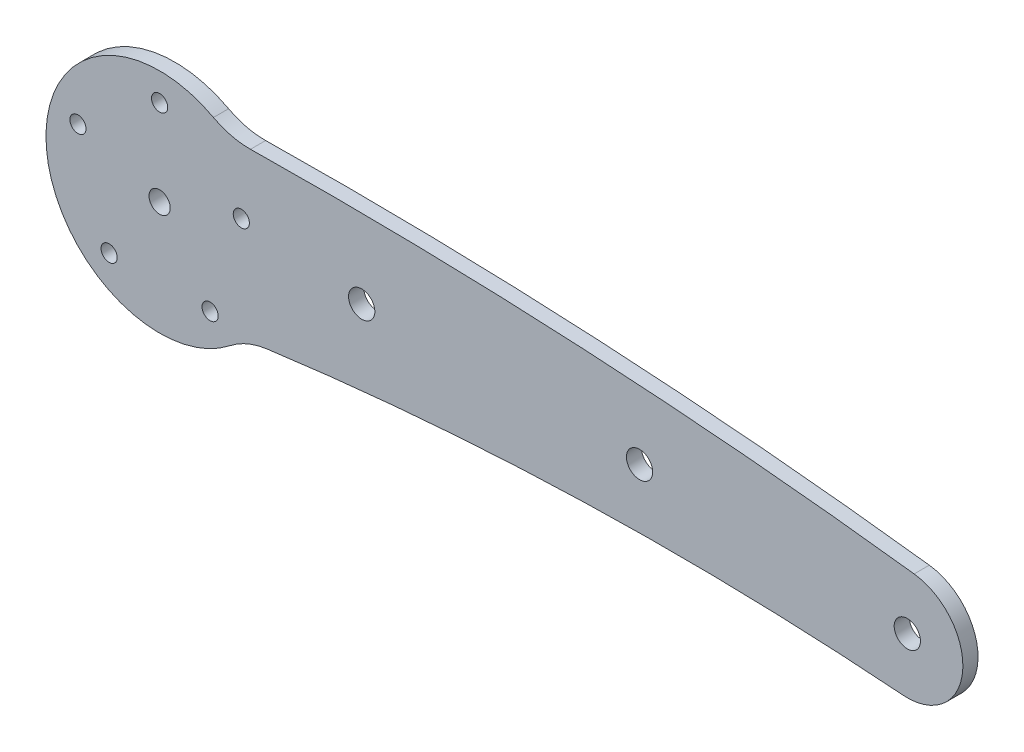
ISO-10303-21;
HEADER;
FILE_DESCRIPTION(('STEP AP214'),'2;1');
FILE_NAME('part.step','',(''),(''),'','','');
FILE_SCHEMA(('AUTOMOTIVE_DESIGN { 1 0 10303 214 1 1 1 1 }'));
ENDSEC;
DATA;
#1=APPLICATION_CONTEXT('core data for automotive mechanical design processes');
#2=APPLICATION_PROTOCOL_DEFINITION('international standard','automotive_design',2000,#1);
#3=PRODUCT_CONTEXT('',#1,'mechanical');
#4=PRODUCT('Part','Part','',(#3));
#5=PRODUCT_RELATED_PRODUCT_CATEGORY('part','',(#4));
#6=PRODUCT_DEFINITION_FORMATION('','',#4);
#7=PRODUCT_DEFINITION_CONTEXT('part definition',#1,'design');
#8=PRODUCT_DEFINITION('design','',#6,#7);
#9=PRODUCT_DEFINITION_SHAPE('','',#8);
#10=(LENGTH_UNIT() NAMED_UNIT(*) SI_UNIT(.MILLI.,.METRE.));
#11=(NAMED_UNIT(*) PLANE_ANGLE_UNIT() SI_UNIT($,.RADIAN.));
#12=(NAMED_UNIT(*) SI_UNIT($,.STERADIAN.) SOLID_ANGLE_UNIT());
#13=UNCERTAINTY_MEASURE_WITH_UNIT(LENGTH_MEASURE(1.E-05),#10,'distance_accuracy_value','');
#14=(GEOMETRIC_REPRESENTATION_CONTEXT(3) GLOBAL_UNCERTAINTY_ASSIGNED_CONTEXT((#13)) GLOBAL_UNIT_ASSIGNED_CONTEXT((#10,
#11,#12)) REPRESENTATION_CONTEXT('',''));
#15=CARTESIAN_POINT('',(0.,0.,0.));
#16=DIRECTION('',(0.,0.,1.));
#17=DIRECTION('',(1.,0.,0.));
#18=AXIS2_PLACEMENT_3D('',#15,#16,#17);
#19=CARTESIAN_POINT('',(16.2151699746623,-465.930427659477,0.));
#20=DIRECTION('',(0.,0.,1.));
#21=DIRECTION('',(1.,0.,0.));
#22=AXIS2_PLACEMENT_3D('',#19,#20,#21);
#23=PLANE('',#22);
#24=CARTESIAN_POINT('',(148.,0.,0.));
#25=DIRECTION('',(0.,0.,1.));
#26=DIRECTION('',(1.,0.,0.));
#27=AXIS2_PLACEMENT_3D('',#24,#25,#26);
#28=CIRCLE('',#27,2.59999999999999);
#29=CARTESIAN_POINT('',(150.6,0.,0.));
#30=VERTEX_POINT('',#29);
#31=EDGE_CURVE('E148',#30,#30,#28,.T.);
#32=ORIENTED_EDGE('',*,*,#31,.T.);
#33=EDGE_LOOP('',(#32));
#34=FACE_BOUND('',#33,.T.);
#35=CARTESIAN_POINT('',(95.,2.5,0.));
#36=DIRECTION('',(0.,0.,1.));
#37=DIRECTION('',(1.,0.,0.));
#38=AXIS2_PLACEMENT_3D('',#35,#36,#37);
#39=CIRCLE('',#38,2.6);
#40=CARTESIAN_POINT('',(97.6,2.5,0.));
#41=VERTEX_POINT('',#40);
#42=EDGE_CURVE('E152',#41,#41,#39,.T.);
#43=ORIENTED_EDGE('',*,*,#42,.T.);
#44=EDGE_LOOP('',(#43));
#45=FACE_BOUND('',#44,.T.);
#46=CARTESIAN_POINT('',(40.,2.5,0.));
#47=DIRECTION('',(0.,0.,1.));
#48=DIRECTION('',(1.,0.,0.));
#49=AXIS2_PLACEMENT_3D('',#46,#47,#48);
#50=CIRCLE('',#49,2.6);
#51=CARTESIAN_POINT('',(42.6,2.5,0.));
#52=VERTEX_POINT('',#51);
#53=EDGE_CURVE('E149',#52,#52,#50,.T.);
#54=ORIENTED_EDGE('',*,*,#53,.T.);
#55=EDGE_LOOP('',(#54));
#56=FACE_BOUND('',#55,.T.);
#57=CARTESIAN_POINT('',(0.,0.,0.));
#58=DIRECTION('',(0.,0.,1.));
#59=DIRECTION('',(1.,0.,0.));
#60=AXIS2_PLACEMENT_3D('',#57,#58,#59);
#61=CIRCLE('',#60,2.1);
#62=CARTESIAN_POINT('',(2.1,0.,0.));
#63=VERTEX_POINT('',#62);
#64=EDGE_CURVE('E138',#63,#63,#61,.T.);
#65=ORIENTED_EDGE('',*,*,#64,.T.);
#66=EDGE_LOOP('',(#65));
#67=FACE_BOUND('',#66,.T.);
#68=CARTESIAN_POINT('',(16.1679607770181,5.25328890437479,0.));
#69=DIRECTION('',(0.,0.,1.));
#70=DIRECTION('',(1.,0.,0.));
#71=AXIS2_PLACEMENT_3D('',#68,#69,#70);
#72=CIRCLE('',#71,1.60000000000033);
#73=CARTESIAN_POINT('',(17.7679607770184,5.25328890437479,0.));
#74=VERTEX_POINT('',#73);
#75=EDGE_CURVE('E133',#74,#74,#72,.T.);
#76=ORIENTED_EDGE('',*,*,#75,.T.);
#77=EDGE_LOOP('',(#76));
#78=FACE_BOUND('',#77,.T.);
#79=CARTESIAN_POINT('',(9.99234928897335,-13.7532889043737,0.));
#80=DIRECTION('',(0.,0.,1.));
#81=DIRECTION('',(1.,0.,0.));
#82=AXIS2_PLACEMENT_3D('',#79,#80,#81);
#83=CIRCLE('',#82,1.60000000000122);
#84=CARTESIAN_POINT('',(11.5923492889746,-13.7532889043737,0.));
#85=VERTEX_POINT('',#84);
#86=EDGE_CURVE('E141',#85,#85,#83,.T.);
#87=ORIENTED_EDGE('',*,*,#86,.T.);
#88=EDGE_LOOP('',(#87));
#89=FACE_BOUND('',#88,.T.);
#90=CARTESIAN_POINT('',(-9.99234928897074,-13.7532889043745,0.));
#91=DIRECTION('',(0.,0.,1.));
#92=DIRECTION('',(1.,0.,0.));
#93=AXIS2_PLACEMENT_3D('',#90,#91,#92);
#94=CIRCLE('',#93,1.60000000000151);
#95=CARTESIAN_POINT('',(-8.39234928896922,-13.7532889043745,0.));
#96=VERTEX_POINT('',#95);
#97=EDGE_CURVE('E137',#96,#96,#94,.T.);
#98=ORIENTED_EDGE('',*,*,#97,.T.);
#99=EDGE_LOOP('',(#98));
#100=FACE_BOUND('',#99,.T.);
#101=CARTESIAN_POINT('',(-16.1679607770171,5.25328890437342,0.));
#102=DIRECTION('',(0.,0.,1.));
#103=DIRECTION('',(1.,0.,0.));
#104=AXIS2_PLACEMENT_3D('',#101,#102,#103);
#105=CIRCLE('',#104,1.60000000000086);
#106=CARTESIAN_POINT('',(-14.5679607770163,5.25328890437342,0.));
#107=VERTEX_POINT('',#106);
#108=EDGE_CURVE('E134',#107,#107,#105,.T.);
#109=ORIENTED_EDGE('',*,*,#108,.T.);
#110=EDGE_LOOP('',(#109));
#111=FACE_BOUND('',#110,.T.);
#112=CARTESIAN_POINT('',(0.,17.,0.));
#113=DIRECTION('',(0.,0.,1.));
#114=DIRECTION('',(1.,0.,0.));
#115=AXIS2_PLACEMENT_3D('',#112,#113,#114);
#116=CIRCLE('',#115,1.6);
#117=CARTESIAN_POINT('',(1.6,17.,0.));
#118=VERTEX_POINT('',#117);
#119=EDGE_CURVE('E130',#118,#118,#116,.T.);
#120=ORIENTED_EDGE('',*,*,#119,.T.);
#121=EDGE_LOOP('',(#120));
#122=FACE_BOUND('',#121,.T.);
#123=CARTESIAN_POINT('',(101.290137246622,-609.211940724704,0.));
#124=DIRECTION('',(0.,0.,-1.));
#125=DIRECTION('',(-1.,0.,0.));
#126=AXIS2_PLACEMENT_3D('',#123,#124,#125);
#127=CIRCLE('',#126,600.);
#128=CARTESIAN_POINT('',(147.159069573998,-10.9678090801501,0.));
#129=VERTEX_POINT('',#128);
#130=CARTESIAN_POINT('',(21.2206318411808,-14.5785458467105,0.));
#131=VERTEX_POINT('',#130);
#132=EDGE_CURVE('E118',#129,#131,#127,.F.);
#133=ORIENTED_EDGE('',*,*,#132,.T.);
#134=CARTESIAN_POINT('',(23.2223694763168,-29.4443807186603,0.));
#135=DIRECTION('',(0.,0.,1.));
#136=DIRECTION('',(1.,0.,0.));
#137=AXIS2_PLACEMENT_3D('',#134,#135,#136);
#138=CIRCLE('',#137,15.);
#139=CARTESIAN_POINT('',(13.9334216857902,-17.6666284311963,0.));
#140=VERTEX_POINT('',#139);
#141=EDGE_CURVE('E11',#131,#140,#138,.T.);
#142=ORIENTED_EDGE('',*,*,#141,.T.);
#143=CARTESIAN_POINT('',(0.,0.,0.));
#144=DIRECTION('',(0.,0.,1.));
#145=DIRECTION('',(1.,0.,0.));
#146=AXIS2_PLACEMENT_3D('',#143,#144,#145);
#147=CIRCLE('',#146,22.5);
#148=CARTESIAN_POINT('',(10.6561368325306,19.8165776007459,0.));
#149=VERTEX_POINT('',#148);
#150=EDGE_CURVE('E119',#149,#140,#147,.T.);
#151=ORIENTED_EDGE('',*,*,#150,.F.);
#152=CARTESIAN_POINT('',(17.7602280542176,33.0276293345766,0.));
#153=DIRECTION('',(0.,0.,1.));
#154=DIRECTION('',(1.,0.,0.));
#155=AXIS2_PLACEMENT_3D('',#152,#153,#154);
#156=CIRCLE('',#155,15.);
#157=CARTESIAN_POINT('',(17.9882608816027,18.0293627337444,0.));
#158=VERTEX_POINT('',#157);
#159=EDGE_CURVE('E46',#149,#158,#156,.T.);
#160=ORIENTED_EDGE('',*,*,#159,.T.);
#161=CARTESIAN_POINT('',(32.4303399493245,-931.860855318953,0.));
#162=DIRECTION('',(0.,0.,-1.));
#163=DIRECTION('',(-1.,0.,0.));
#164=AXIS2_PLACEMENT_3D('',#161,#162,#163);
#165=CIRCLE('',#164,950.);
#166=CARTESIAN_POINT('',(149.353851182702,10.9163678471869,0.));
#167=VERTEX_POINT('',#166);
#168=EDGE_CURVE('E115',#167,#158,#165,.F.);
#169=ORIENTED_EDGE('',*,*,#168,.F.);
#170=CARTESIAN_POINT('',(148.,0.,0.));
#171=DIRECTION('',(0.,0.,-1.));
#172=DIRECTION('',(-1.,0.,0.));
#173=AXIS2_PLACEMENT_3D('',#170,#171,#172);
#174=CIRCLE('',#173,10.9999999999999);
#175=EDGE_CURVE('E121',#129,#167,#174,.F.);
#176=ORIENTED_EDGE('',*,*,#175,.F.);
#177=EDGE_LOOP('',(#133,#142,#151,#160,#169,#176));
#178=FACE_BOUND('',#177,.T.);
#179=ADVANCED_FACE('F37',(#34,#45,#56,#67,#78,#89,#100,#111,#122,#178),#23,.F.);
#180=CARTESIAN_POINT('',(32.4303399493245,-931.860855318953,5.));
#181=DIRECTION('',(0.,0.,-1.));
#182=DIRECTION('',(-1.,0.,0.));
#183=AXIS2_PLACEMENT_3D('',#180,#181,#182);
#184=CYLINDRICAL_SURFACE('',#183,950.);
#185=CARTESIAN_POINT('',(32.4303399493245,-931.860855318953,3.));
#186=DIRECTION('',(0.,0.,-1.));
#187=DIRECTION('',(-1.,0.,0.));
#188=AXIS2_PLACEMENT_3D('',#185,#186,#187);
#189=CIRCLE('',#188,950.);
#190=CARTESIAN_POINT('',(149.353851182702,10.9163678471868,3.));
#191=VERTEX_POINT('',#190);
#192=CARTESIAN_POINT('',(17.9882608816027,18.0293627337445,3.));
#193=VERTEX_POINT('',#192);
#194=EDGE_CURVE('E172',#191,#193,#189,.F.);
#195=ORIENTED_EDGE('',*,*,#194,.F.);
#196=DIRECTION('',(0.,0.,-1.));
#197=VECTOR('',#196,1.);
#198=CARTESIAN_POINT('',(149.353851182702,10.9163678471868,5.));
#199=LINE('',#198,#197);
#200=EDGE_CURVE('E124',#167,#191,#199,.F.);
#201=ORIENTED_EDGE('',*,*,#200,.F.);
#202=ORIENTED_EDGE('',*,*,#168,.T.);
#203=DIRECTION('',(0.,0.,-1.));
#204=VECTOR('',#203,1.);
#205=CARTESIAN_POINT('',(17.9882608816027,18.0293627337446,5.));
#206=LINE('',#205,#204);
#207=EDGE_CURVE('E105',#158,#193,#206,.F.);
#208=ORIENTED_EDGE('',*,*,#207,.T.);
#209=EDGE_LOOP('',(#195,#201,#202,#208));
#210=FACE_BOUND('',#209,.T.);
#211=ADVANCED_FACE('F210',(#210),#184,.T.);
#212=CARTESIAN_POINT('',(101.290137246622,-609.211940724704,5.));
#213=DIRECTION('',(0.,0.,-1.));
#214=DIRECTION('',(-1.,0.,0.));
#215=AXIS2_PLACEMENT_3D('',#212,#213,#214);
#216=CYLINDRICAL_SURFACE('',#215,600.);
#217=DIRECTION('',(0.,0.,-1.));
#218=VECTOR('',#217,1.);
#219=CARTESIAN_POINT('',(147.159069573998,-10.9678090801501,5.));
#220=LINE('',#219,#218);
#221=CARTESIAN_POINT('',(147.159069573998,-10.9678090801502,3.));
#222=VERTEX_POINT('',#221);
#223=EDGE_CURVE('E101',#222,#129,#220,.T.);
#224=ORIENTED_EDGE('',*,*,#223,.F.);
#225=CARTESIAN_POINT('',(101.290137246622,-609.211940724704,3.));
#226=DIRECTION('',(0.,0.,-1.));
#227=DIRECTION('',(-1.,0.,0.));
#228=AXIS2_PLACEMENT_3D('',#225,#226,#227);
#229=CIRCLE('',#228,600.);
#230=CARTESIAN_POINT('',(21.2206318411808,-14.5785458467105,3.));
#231=VERTEX_POINT('',#230);
#232=EDGE_CURVE('E92',#222,#231,#229,.F.);
#233=ORIENTED_EDGE('',*,*,#232,.T.);
#234=DIRECTION('',(0.,0.,-1.));
#235=VECTOR('',#234,1.);
#236=CARTESIAN_POINT('',(21.2206318411808,-14.5785458467105,5.));
#237=LINE('',#236,#235);
#238=EDGE_CURVE('E61',#231,#131,#237,.T.);
#239=ORIENTED_EDGE('',*,*,#238,.T.);
#240=ORIENTED_EDGE('',*,*,#132,.F.);
#241=EDGE_LOOP('',(#224,#233,#239,#240));
#242=FACE_BOUND('',#241,.T.);
#243=ADVANCED_FACE('F100',(#242),#216,.F.);
#244=CARTESIAN_POINT('',(148.,0.,5.));
#245=DIRECTION('',(0.,0.,-1.));
#246=DIRECTION('',(-1.,0.,0.));
#247=AXIS2_PLACEMENT_3D('',#244,#245,#246);
#248=CYLINDRICAL_SURFACE('',#247,10.9999999999999);
#249=CARTESIAN_POINT('',(148.,0.,3.));
#250=DIRECTION('',(0.,0.,-1.));
#251=DIRECTION('',(-1.,0.,0.));
#252=AXIS2_PLACEMENT_3D('',#249,#250,#251);
#253=CIRCLE('',#252,10.9999999999999);
#254=EDGE_CURVE('E174',#222,#191,#253,.F.);
#255=ORIENTED_EDGE('',*,*,#254,.F.);
#256=ORIENTED_EDGE('',*,*,#223,.T.);
#257=ORIENTED_EDGE('',*,*,#175,.T.);
#258=ORIENTED_EDGE('',*,*,#200,.T.);
#259=EDGE_LOOP('',(#255,#256,#257,#258));
#260=FACE_BOUND('',#259,.T.);
#261=ADVANCED_FACE('F230',(#260),#248,.T.);
#262=CARTESIAN_POINT('',(0.,0.,0.));
#263=DIRECTION('',(0.,0.,1.));
#264=DIRECTION('',(1.,0.,0.));
#265=AXIS2_PLACEMENT_3D('',#262,#263,#264);
#266=CYLINDRICAL_SURFACE('',#265,22.5);
#267=CARTESIAN_POINT('',(0.,0.,3.));
#268=DIRECTION('',(0.,0.,-1.));
#269=DIRECTION('',(-1.,0.,0.));
#270=AXIS2_PLACEMENT_3D('',#267,#268,#269);
#271=CIRCLE('',#270,22.5);
#272=CARTESIAN_POINT('',(10.6561368325306,19.8165776007459,3.));
#273=VERTEX_POINT('',#272);
#274=CARTESIAN_POINT('',(13.9334216857902,-17.6666284311963,3.));
#275=VERTEX_POINT('',#274);
#276=EDGE_CURVE('E53',#273,#275,#271,.F.);
#277=ORIENTED_EDGE('',*,*,#276,.F.);
#278=DIRECTION('',(0.,0.,1.));
#279=VECTOR('',#278,1.);
#280=CARTESIAN_POINT('',(10.6561368325306,19.8165776007459,0.));
#281=LINE('',#280,#279);
#282=EDGE_CURVE('E109',#273,#149,#281,.F.);
#283=ORIENTED_EDGE('',*,*,#282,.T.);
#284=ORIENTED_EDGE('',*,*,#150,.T.);
#285=DIRECTION('',(0.,0.,1.));
#286=VECTOR('',#285,1.);
#287=CARTESIAN_POINT('',(13.9334216857902,-17.6666284311963,0.));
#288=LINE('',#287,#286);
#289=EDGE_CURVE('E113',#140,#275,#288,.T.);
#290=ORIENTED_EDGE('',*,*,#289,.T.);
#291=EDGE_LOOP('',(#277,#283,#284,#290));
#292=FACE_BOUND('',#291,.T.);
#293=ADVANCED_FACE('F213',(#292),#266,.T.);
#294=CARTESIAN_POINT('',(0.,17.,0.));
#295=DIRECTION('',(0.,0.,1.));
#296=DIRECTION('',(1.,0.,0.));
#297=AXIS2_PLACEMENT_3D('',#294,#295,#296);
#298=CYLINDRICAL_SURFACE('',#297,1.6);
#299=CARTESIAN_POINT('',(0.,17.,3.));
#300=DIRECTION('',(0.,0.,-1.));
#301=DIRECTION('',(-1.,0.,0.));
#302=AXIS2_PLACEMENT_3D('',#299,#300,#301);
#303=CIRCLE('',#302,1.6);
#304=CARTESIAN_POINT('',(-1.6,17.,3.));
#305=VERTEX_POINT('',#304);
#306=EDGE_CURVE('E153',#305,#305,#303,.F.);
#307=ORIENTED_EDGE('',*,*,#306,.T.);
#308=EDGE_LOOP('',(#307));
#309=FACE_BOUND('',#308,.T.);
#310=ORIENTED_EDGE('',*,*,#119,.F.);
#311=EDGE_LOOP('',(#310));
#312=FACE_BOUND('',#311,.T.);
#313=ADVANCED_FACE('F240',(#309,#312),#298,.F.);
#314=CARTESIAN_POINT('',(-16.1679607770171,5.25328890437342,0.));
#315=DIRECTION('',(0.,0.,1.));
#316=DIRECTION('',(1.,0.,0.));
#317=AXIS2_PLACEMENT_3D('',#314,#315,#316);
#318=CYLINDRICAL_SURFACE('',#317,1.60000000000086);
#319=CARTESIAN_POINT('',(-16.1679607770171,5.25328890437342,3.));
#320=DIRECTION('',(0.,0.,-1.));
#321=DIRECTION('',(-1.,0.,0.));
#322=AXIS2_PLACEMENT_3D('',#319,#320,#321);
#323=CIRCLE('',#322,1.60000000000086);
#324=CARTESIAN_POINT('',(-17.767960777018,5.25328890437342,3.));
#325=VERTEX_POINT('',#324);
#326=EDGE_CURVE('E160',#325,#325,#323,.F.);
#327=ORIENTED_EDGE('',*,*,#326,.T.);
#328=EDGE_LOOP('',(#327));
#329=FACE_BOUND('',#328,.T.);
#330=ORIENTED_EDGE('',*,*,#108,.F.);
#331=EDGE_LOOP('',(#330));
#332=FACE_BOUND('',#331,.T.);
#333=ADVANCED_FACE('F246',(#329,#332),#318,.F.);
#334=CARTESIAN_POINT('',(-9.99234928897074,-13.7532889043745,0.));
#335=DIRECTION('',(0.,0.,1.));
#336=DIRECTION('',(1.,0.,0.));
#337=AXIS2_PLACEMENT_3D('',#334,#335,#336);
#338=CYLINDRICAL_SURFACE('',#337,1.60000000000151);
#339=CARTESIAN_POINT('',(-9.99234928897074,-13.7532889043745,3.));
#340=DIRECTION('',(0.,0.,-1.));
#341=DIRECTION('',(-1.,0.,0.));
#342=AXIS2_PLACEMENT_3D('',#339,#340,#341);
#343=CIRCLE('',#342,1.60000000000151);
#344=CARTESIAN_POINT('',(-11.5923492889723,-13.7532889043745,3.));
#345=VERTEX_POINT('',#344);
#346=EDGE_CURVE('E163',#345,#345,#343,.F.);
#347=ORIENTED_EDGE('',*,*,#346,.T.);
#348=EDGE_LOOP('',(#347));
#349=FACE_BOUND('',#348,.T.);
#350=ORIENTED_EDGE('',*,*,#97,.F.);
#351=EDGE_LOOP('',(#350));
#352=FACE_BOUND('',#351,.T.);
#353=ADVANCED_FACE('F267',(#349,#352),#338,.F.);
#354=CARTESIAN_POINT('',(9.99234928897335,-13.7532889043737,0.));
#355=DIRECTION('',(0.,0.,1.));
#356=DIRECTION('',(1.,0.,0.));
#357=AXIS2_PLACEMENT_3D('',#354,#355,#356);
#358=CYLINDRICAL_SURFACE('',#357,1.60000000000122);
#359=CARTESIAN_POINT('',(9.99234928897335,-13.7532889043737,3.));
#360=DIRECTION('',(0.,0.,-1.));
#361=DIRECTION('',(-1.,0.,0.));
#362=AXIS2_PLACEMENT_3D('',#359,#360,#361);
#363=CIRCLE('',#362,1.60000000000122);
#364=CARTESIAN_POINT('',(8.39234928897213,-13.7532889043737,3.));
#365=VERTEX_POINT('',#364);
#366=EDGE_CURVE('E166',#365,#365,#363,.F.);
#367=ORIENTED_EDGE('',*,*,#366,.T.);
#368=EDGE_LOOP('',(#367));
#369=FACE_BOUND('',#368,.T.);
#370=ORIENTED_EDGE('',*,*,#86,.F.);
#371=EDGE_LOOP('',(#370));
#372=FACE_BOUND('',#371,.T.);
#373=ADVANCED_FACE('F261',(#369,#372),#358,.F.);
#374=CARTESIAN_POINT('',(16.1679607770181,5.25328890437479,0.));
#375=DIRECTION('',(0.,0.,1.));
#376=DIRECTION('',(1.,0.,0.));
#377=AXIS2_PLACEMENT_3D('',#374,#375,#376);
#378=CYLINDRICAL_SURFACE('',#377,1.60000000000033);
#379=CARTESIAN_POINT('',(16.1679607770181,5.25328890437479,3.));
#380=DIRECTION('',(0.,0.,-1.));
#381=DIRECTION('',(-1.,0.,0.));
#382=AXIS2_PLACEMENT_3D('',#379,#380,#381);
#383=CIRCLE('',#382,1.60000000000033);
#384=CARTESIAN_POINT('',(14.5679607770178,5.25328890437479,3.));
#385=VERTEX_POINT('',#384);
#386=EDGE_CURVE('E169',#385,#385,#383,.F.);
#387=ORIENTED_EDGE('',*,*,#386,.T.);
#388=EDGE_LOOP('',(#387));
#389=FACE_BOUND('',#388,.T.);
#390=ORIENTED_EDGE('',*,*,#75,.F.);
#391=EDGE_LOOP('',(#390));
#392=FACE_BOUND('',#391,.T.);
#393=ADVANCED_FACE('F256',(#389,#392),#378,.F.);
#394=CARTESIAN_POINT('',(17.7602280542176,33.0276293345766,5.));
#395=DIRECTION('',(0.,0.,1.));
#396=DIRECTION('',(1.,0.,0.));
#397=AXIS2_PLACEMENT_3D('',#394,#395,#396);
#398=CYLINDRICAL_SURFACE('',#397,15.);
#399=ORIENTED_EDGE('',*,*,#282,.F.);
#400=CARTESIAN_POINT('',(17.7602280542176,33.0276293345766,3.));
#401=DIRECTION('',(0.,0.,-1.));
#402=DIRECTION('',(-1.,0.,0.));
#403=AXIS2_PLACEMENT_3D('',#400,#401,#402);
#404=CIRCLE('',#403,15.);
#405=EDGE_CURVE('E102',#273,#193,#404,.F.);
#406=ORIENTED_EDGE('',*,*,#405,.T.);
#407=ORIENTED_EDGE('',*,*,#207,.F.);
#408=ORIENTED_EDGE('',*,*,#159,.F.);
#409=EDGE_LOOP('',(#399,#406,#407,#408));
#410=FACE_BOUND('',#409,.T.);
#411=ADVANCED_FACE('F237',(#410),#398,.F.);
#412=CARTESIAN_POINT('',(23.2223694763168,-29.4443807186603,0.));
#413=DIRECTION('',(0.,0.,-1.));
#414=DIRECTION('',(-1.,0.,0.));
#415=AXIS2_PLACEMENT_3D('',#412,#413,#414);
#416=CYLINDRICAL_SURFACE('',#415,15.);
#417=ORIENTED_EDGE('',*,*,#238,.F.);
#418=CARTESIAN_POINT('',(23.2223694763168,-29.4443807186603,3.));
#419=DIRECTION('',(0.,0.,-1.));
#420=DIRECTION('',(-1.,0.,0.));
#421=AXIS2_PLACEMENT_3D('',#418,#419,#420);
#422=CIRCLE('',#421,15.);
#423=EDGE_CURVE('E89',#231,#275,#422,.F.);
#424=ORIENTED_EDGE('',*,*,#423,.T.);
#425=ORIENTED_EDGE('',*,*,#289,.F.);
#426=ORIENTED_EDGE('',*,*,#141,.F.);
#427=EDGE_LOOP('',(#417,#424,#425,#426));
#428=FACE_BOUND('',#427,.T.);
#429=ADVANCED_FACE('F39',(#428),#416,.F.);
#430=CARTESIAN_POINT('',(0.,0.,0.));
#431=DIRECTION('',(0.,0.,1.));
#432=DIRECTION('',(1.,0.,0.));
#433=AXIS2_PLACEMENT_3D('',#430,#431,#432);
#434=CYLINDRICAL_SURFACE('',#433,2.1);
#435=CARTESIAN_POINT('',(0.,0.,3.));
#436=DIRECTION('',(0.,0.,-1.));
#437=DIRECTION('',(-1.,0.,0.));
#438=AXIS2_PLACEMENT_3D('',#435,#436,#437);
#439=CIRCLE('',#438,2.1);
#440=CARTESIAN_POINT('',(-2.1,0.,3.));
#441=VERTEX_POINT('',#440);
#442=EDGE_CURVE('E97',#441,#441,#439,.F.);
#443=ORIENTED_EDGE('',*,*,#442,.T.);
#444=EDGE_LOOP('',(#443));
#445=FACE_BOUND('',#444,.T.);
#446=ORIENTED_EDGE('',*,*,#64,.F.);
#447=EDGE_LOOP('',(#446));
#448=FACE_BOUND('',#447,.T.);
#449=ADVANCED_FACE('F204',(#445,#448),#434,.F.);
#450=CARTESIAN_POINT('',(40.,2.5,0.));
#451=DIRECTION('',(0.,0.,1.));
#452=DIRECTION('',(1.,0.,0.));
#453=AXIS2_PLACEMENT_3D('',#450,#451,#452);
#454=CYLINDRICAL_SURFACE('',#453,2.6);
#455=CARTESIAN_POINT('',(40.,2.5,3.));
#456=DIRECTION('',(0.,0.,-1.));
#457=DIRECTION('',(-1.,0.,0.));
#458=AXIS2_PLACEMENT_3D('',#455,#456,#457);
#459=CIRCLE('',#458,2.6);
#460=CARTESIAN_POINT('',(37.4,2.5,3.));
#461=VERTEX_POINT('',#460);
#462=EDGE_CURVE('E181',#461,#461,#459,.F.);
#463=ORIENTED_EDGE('',*,*,#462,.T.);
#464=EDGE_LOOP('',(#463));
#465=FACE_BOUND('',#464,.T.);
#466=ORIENTED_EDGE('',*,*,#53,.F.);
#467=EDGE_LOOP('',(#466));
#468=FACE_BOUND('',#467,.T.);
#469=ADVANCED_FACE('F200',(#465,#468),#454,.F.);
#470=CARTESIAN_POINT('',(95.,2.5,0.));
#471=DIRECTION('',(0.,0.,1.));
#472=DIRECTION('',(1.,0.,0.));
#473=AXIS2_PLACEMENT_3D('',#470,#471,#472);
#474=CYLINDRICAL_SURFACE('',#473,2.6);
#475=CARTESIAN_POINT('',(95.,2.5,3.));
#476=DIRECTION('',(0.,0.,-1.));
#477=DIRECTION('',(-1.,0.,0.));
#478=AXIS2_PLACEMENT_3D('',#475,#476,#477);
#479=CIRCLE('',#478,2.6);
#480=CARTESIAN_POINT('',(92.4,2.5,3.));
#481=VERTEX_POINT('',#480);
#482=EDGE_CURVE('E184',#481,#481,#479,.F.);
#483=ORIENTED_EDGE('',*,*,#482,.T.);
#484=EDGE_LOOP('',(#483));
#485=FACE_BOUND('',#484,.T.);
#486=ORIENTED_EDGE('',*,*,#42,.F.);
#487=EDGE_LOOP('',(#486));
#488=FACE_BOUND('',#487,.T.);
#489=ADVANCED_FACE('F203',(#485,#488),#474,.F.);
#490=CARTESIAN_POINT('',(148.,0.,0.));
#491=DIRECTION('',(0.,0.,1.));
#492=DIRECTION('',(1.,0.,0.));
#493=AXIS2_PLACEMENT_3D('',#490,#491,#492);
#494=CYLINDRICAL_SURFACE('',#493,2.59999999999999);
#495=CARTESIAN_POINT('',(148.,0.,3.));
#496=DIRECTION('',(0.,0.,-1.));
#497=DIRECTION('',(-1.,0.,0.));
#498=AXIS2_PLACEMENT_3D('',#495,#496,#497);
#499=CIRCLE('',#498,2.59999999999999);
#500=CARTESIAN_POINT('',(145.4,0.,3.));
#501=VERTEX_POINT('',#500);
#502=EDGE_CURVE('E41',#501,#501,#499,.F.);
#503=ORIENTED_EDGE('',*,*,#502,.T.);
#504=EDGE_LOOP('',(#503));
#505=FACE_BOUND('',#504,.T.);
#506=ORIENTED_EDGE('',*,*,#31,.F.);
#507=EDGE_LOOP('',(#506));
#508=FACE_BOUND('',#507,.T.);
#509=ADVANCED_FACE('F191',(#505,#508),#494,.F.);
#510=CARTESIAN_POINT('',(0.,0.,3.));
#511=DIRECTION('',(0.,0.,-1.));
#512=DIRECTION('',(-1.,0.,0.));
#513=AXIS2_PLACEMENT_3D('',#510,#511,#512);
#514=PLANE('',#513);
#515=ORIENTED_EDGE('',*,*,#326,.F.);
#516=EDGE_LOOP('',(#515));
#517=FACE_BOUND('',#516,.T.);
#518=ORIENTED_EDGE('',*,*,#366,.F.);
#519=EDGE_LOOP('',(#518));
#520=FACE_BOUND('',#519,.T.);
#521=ORIENTED_EDGE('',*,*,#442,.F.);
#522=EDGE_LOOP('',(#521));
#523=FACE_BOUND('',#522,.T.);
#524=ORIENTED_EDGE('',*,*,#482,.F.);
#525=EDGE_LOOP('',(#524));
#526=FACE_BOUND('',#525,.T.);
#527=ORIENTED_EDGE('',*,*,#502,.F.);
#528=EDGE_LOOP('',(#527));
#529=FACE_BOUND('',#528,.T.);
#530=ORIENTED_EDGE('',*,*,#462,.F.);
#531=EDGE_LOOP('',(#530));
#532=FACE_BOUND('',#531,.T.);
#533=ORIENTED_EDGE('',*,*,#194,.T.);
#534=ORIENTED_EDGE('',*,*,#405,.F.);
#535=ORIENTED_EDGE('',*,*,#276,.T.);
#536=ORIENTED_EDGE('',*,*,#423,.F.);
#537=ORIENTED_EDGE('',*,*,#232,.F.);
#538=ORIENTED_EDGE('',*,*,#254,.T.);
#539=EDGE_LOOP('',(#533,#534,#535,#536,#537,#538));
#540=FACE_BOUND('',#539,.T.);
#541=ORIENTED_EDGE('',*,*,#386,.F.);
#542=EDGE_LOOP('',(#541));
#543=FACE_BOUND('',#542,.T.);
#544=ORIENTED_EDGE('',*,*,#346,.F.);
#545=EDGE_LOOP('',(#544));
#546=FACE_BOUND('',#545,.T.);
#547=ORIENTED_EDGE('',*,*,#306,.F.);
#548=EDGE_LOOP('',(#547));
#549=FACE_BOUND('',#548,.T.);
#550=ADVANCED_FACE('F90',(#517,#520,#523,#526,#529,#532,#540,#543,#546,#549),#514,.F.);
#551=CLOSED_SHELL('',(#179,#211,#243,#261,#293,#313,#333,#353,#373,#393,#411,#429,#449,#469,
#489,#509,#550));
#552=MANIFOLD_SOLID_BREP('B2',#551);
#553=ADVANCED_BREP_SHAPE_REPRESENTATION('',(#18,#552),#14);
#554=SHAPE_DEFINITION_REPRESENTATION(#9,#553);
ENDSEC;
END-ISO-10303-21;
